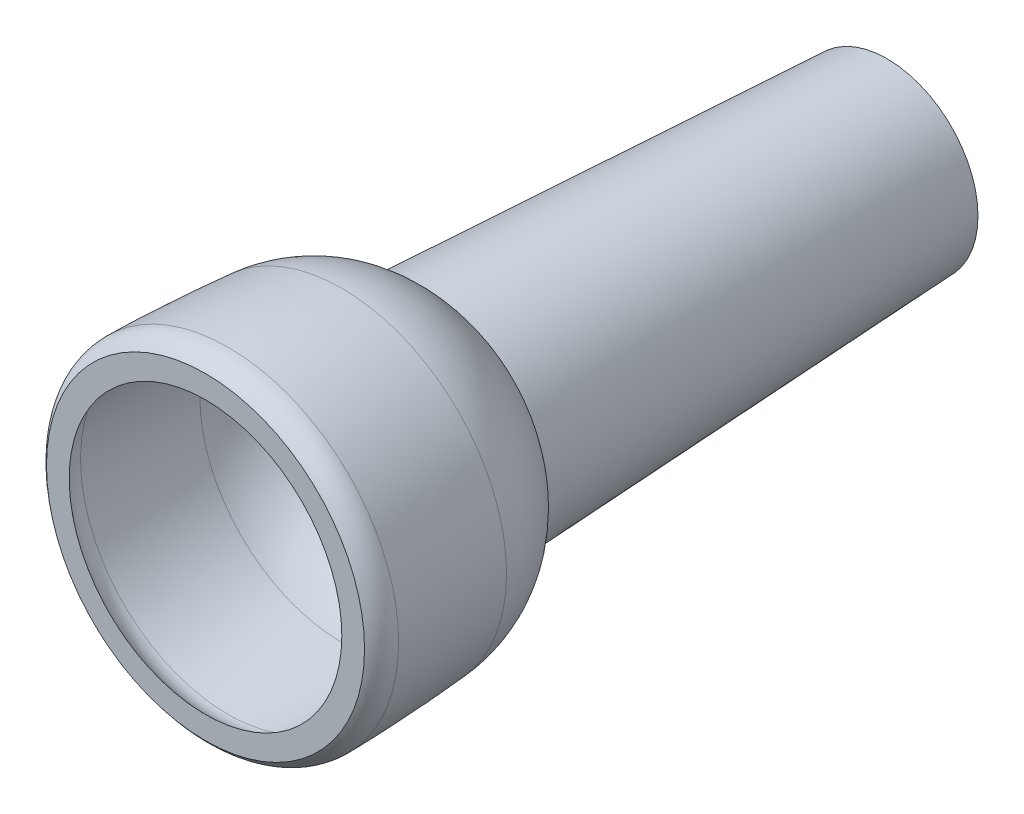
ISO-10303-21;
HEADER;
FILE_DESCRIPTION(('STEP AP214'),'2;1');
FILE_NAME('part.step','',(''),(''),'','','');
FILE_SCHEMA(('AUTOMOTIVE_DESIGN { 1 0 10303 214 1 1 1 1 }'));
ENDSEC;
DATA;
#1=APPLICATION_CONTEXT('core data for automotive mechanical design processes');
#2=APPLICATION_PROTOCOL_DEFINITION('international standard','automotive_design',2000,#1);
#3=PRODUCT_CONTEXT('',#1,'mechanical');
#4=PRODUCT('Part','Part','',(#3));
#5=PRODUCT_RELATED_PRODUCT_CATEGORY('part','',(#4));
#6=PRODUCT_DEFINITION_FORMATION('','',#4);
#7=PRODUCT_DEFINITION_CONTEXT('part definition',#1,'design');
#8=PRODUCT_DEFINITION('design','',#6,#7);
#9=PRODUCT_DEFINITION_SHAPE('','',#8);
#10=(LENGTH_UNIT() NAMED_UNIT(*) SI_UNIT(.MILLI.,.METRE.));
#11=(NAMED_UNIT(*) PLANE_ANGLE_UNIT() SI_UNIT($,.RADIAN.));
#12=(NAMED_UNIT(*) SI_UNIT($,.STERADIAN.) SOLID_ANGLE_UNIT());
#13=UNCERTAINTY_MEASURE_WITH_UNIT(LENGTH_MEASURE(1.E-05),#10,'distance_accuracy_value','');
#14=(GEOMETRIC_REPRESENTATION_CONTEXT(3) GLOBAL_UNCERTAINTY_ASSIGNED_CONTEXT((#13)) GLOBAL_UNIT_ASSIGNED_CONTEXT((#10,
#11,#12)) REPRESENTATION_CONTEXT('',''));
#15=CARTESIAN_POINT('',(0.,0.,0.));
#16=DIRECTION('',(0.,0.,1.));
#17=DIRECTION('',(1.,0.,0.));
#18=AXIS2_PLACEMENT_3D('',#15,#16,#17);
#19=CARTESIAN_POINT('',(0.,0.,-20.));
#20=DIRECTION('',(0.,0.,1.));
#21=DIRECTION('',(0.,1.,0.));
#22=AXIS2_PLACEMENT_3D('',#19,#20,#21);
#23=CONICAL_SURFACE('',#22,3.5,0.0499583957219433);
#24=CARTESIAN_POINT('',(0.,0.,-30.));
#25=DIRECTION('',(0.,0.,-1.));
#26=DIRECTION('',(1.,0.,0.));
#27=AXIS2_PLACEMENT_3D('',#24,#25,#26);
#28=CIRCLE('',#27,3.);
#29=CARTESIAN_POINT('',(0.,3.,-30.));
#30=VERTEX_POINT('',#29);
#31=CARTESIAN_POINT('',(0.,-3.,-30.));
#32=VERTEX_POINT('',#31);
#33=EDGE_CURVE('E242',#30,#32,#28,.T.);
#34=ORIENTED_EDGE('',*,*,#33,.T.);
#35=DIRECTION('',(0.,-0.0499376169438921,0.998752338877845));
#36=VECTOR('',#35,1.);
#37=CARTESIAN_POINT('',(0.,-3.5,-20.));
#38=LINE('',#37,#36);
#39=CARTESIAN_POINT('',(0.,-4.,-10.));
#40=VERTEX_POINT('',#39);
#41=EDGE_CURVE('E11',#32,#40,#38,.T.);
#42=ORIENTED_EDGE('',*,*,#41,.T.);
#43=CARTESIAN_POINT('',(0.,0.,-10.));
#44=DIRECTION('',(0.,0.,-1.));
#45=DIRECTION('',(1.,0.,0.));
#46=AXIS2_PLACEMENT_3D('',#43,#44,#45);
#47=CIRCLE('',#46,4.);
#48=CARTESIAN_POINT('',(4.,0.,-10.));
#49=VERTEX_POINT('',#48);
#50=EDGE_CURVE('E145',#49,#40,#47,.T.);
#51=ORIENTED_EDGE('',*,*,#50,.F.);
#52=CARTESIAN_POINT('',(0.,0.,-10.));
#53=DIRECTION('',(0.,0.,-1.));
#54=DIRECTION('',(1.,0.,0.));
#55=AXIS2_PLACEMENT_3D('',#52,#53,#54);
#56=CIRCLE('',#55,4.);
#57=CARTESIAN_POINT('',(0.,4.,-10.));
#58=VERTEX_POINT('',#57);
#59=EDGE_CURVE('E149',#58,#49,#56,.T.);
#60=ORIENTED_EDGE('',*,*,#59,.F.);
#61=CARTESIAN_POINT('',(0.,0.,-10.));
#62=DIRECTION('',(0.,0.,-1.));
#63=DIRECTION('',(1.,0.,0.));
#64=AXIS2_PLACEMENT_3D('',#61,#62,#63);
#65=CIRCLE('',#64,4.);
#66=EDGE_CURVE('E152',#40,#58,#65,.T.);
#67=ORIENTED_EDGE('',*,*,#66,.F.);
#68=ORIENTED_EDGE('',*,*,#41,.F.);
#69=CARTESIAN_POINT('',(0.,0.,-30.));
#70=DIRECTION('',(0.,0.,-1.));
#71=DIRECTION('',(1.,0.,0.));
#72=AXIS2_PLACEMENT_3D('',#69,#70,#71);
#73=CIRCLE('',#72,3.);
#74=EDGE_CURVE('E27',#32,#30,#73,.T.);
#75=ORIENTED_EDGE('',*,*,#74,.T.);
#76=EDGE_LOOP('',(#34,#42,#51,#60,#67,#68,#75));
#77=FACE_BOUND('',#76,.T.);
#78=ADVANCED_FACE('F16',(#77),#23,.F.);
#79=CARTESIAN_POINT('',(0.,3.,-30.));
#80=DIRECTION('',(0.,0.,-1.));
#81=DIRECTION('',(0.,-1.,0.));
#82=AXIS2_PLACEMENT_3D('',#79,#80,#81);
#83=PLANE('',#82);
#84=ORIENTED_EDGE('',*,*,#33,.F.);
#85=ORIENTED_EDGE('',*,*,#74,.F.);
#86=EDGE_LOOP('',(#84,#85));
#87=FACE_BOUND('',#86,.T.);
#88=CARTESIAN_POINT('',(0.,0.,-30.));
#89=DIRECTION('',(0.,0.,-1.));
#90=DIRECTION('',(1.,0.,0.));
#91=AXIS2_PLACEMENT_3D('',#88,#89,#90);
#92=CIRCLE('',#91,4.);
#93=CARTESIAN_POINT('',(0.,4.,-30.));
#94=VERTEX_POINT('',#93);
#95=CARTESIAN_POINT('',(0.,-4.,-30.));
#96=VERTEX_POINT('',#95);
#97=EDGE_CURVE('E220',#94,#96,#92,.T.);
#98=ORIENTED_EDGE('',*,*,#97,.T.);
#99=CARTESIAN_POINT('',(0.,0.,-30.));
#100=DIRECTION('',(0.,0.,-1.));
#101=DIRECTION('',(1.,0.,0.));
#102=AXIS2_PLACEMENT_3D('',#99,#100,#101);
#103=CIRCLE('',#102,4.);
#104=EDGE_CURVE('E216',#96,#94,#103,.T.);
#105=ORIENTED_EDGE('',*,*,#104,.T.);
#106=EDGE_LOOP('',(#98,#105));
#107=FACE_BOUND('',#106,.T.);
#108=ADVANCED_FACE('F18',(#87,#107),#83,.T.);
#109=CARTESIAN_POINT('',(0.,0.,-20.));
#110=DIRECTION('',(0.,0.,1.));
#111=DIRECTION('',(0.,1.,0.));
#112=AXIS2_PLACEMENT_3D('',#109,#110,#111);
#113=CONICAL_SURFACE('',#112,4.5,0.0499583957219433);
#114=ORIENTED_EDGE('',*,*,#97,.F.);
#115=ORIENTED_EDGE('',*,*,#104,.F.);
#116=DIRECTION('',(0.,-0.0499376169438921,0.998752338877845));
#117=VECTOR('',#116,1.);
#118=CARTESIAN_POINT('',(0.,-4.5,-20.));
#119=LINE('',#118,#117);
#120=CARTESIAN_POINT('',(0.,-5.,-10.));
#121=VERTEX_POINT('',#120);
#122=EDGE_CURVE('E219',#96,#121,#119,.T.);
#123=ORIENTED_EDGE('',*,*,#122,.T.);
#124=CARTESIAN_POINT('',(0.,0.,-10.));
#125=DIRECTION('',(0.,0.,-1.));
#126=DIRECTION('',(1.,0.,0.));
#127=AXIS2_PLACEMENT_3D('',#124,#125,#126);
#128=CIRCLE('',#127,5.);
#129=CARTESIAN_POINT('',(0.,5.,-10.));
#130=VERTEX_POINT('',#129);
#131=EDGE_CURVE('E81',#121,#130,#128,.T.);
#132=ORIENTED_EDGE('',*,*,#131,.T.);
#133=CARTESIAN_POINT('',(0.,0.,-10.));
#134=DIRECTION('',(0.,0.,-1.));
#135=DIRECTION('',(1.,0.,0.));
#136=AXIS2_PLACEMENT_3D('',#133,#134,#135);
#137=CIRCLE('',#136,5.);
#138=CARTESIAN_POINT('',(5.,0.,-10.));
#139=VERTEX_POINT('',#138);
#140=EDGE_CURVE('E173',#130,#139,#137,.T.);
#141=ORIENTED_EDGE('',*,*,#140,.T.);
#142=CARTESIAN_POINT('',(0.,0.,-10.));
#143=DIRECTION('',(0.,0.,-1.));
#144=DIRECTION('',(1.,0.,0.));
#145=AXIS2_PLACEMENT_3D('',#142,#143,#144);
#146=CIRCLE('',#145,5.);
#147=EDGE_CURVE('E179',#139,#121,#146,.T.);
#148=ORIENTED_EDGE('',*,*,#147,.T.);
#149=ORIENTED_EDGE('',*,*,#122,.F.);
#150=EDGE_LOOP('',(#114,#115,#123,#132,#141,#148,#149));
#151=FACE_BOUND('',#150,.T.);
#152=ADVANCED_FACE('F280',(#151),#113,.T.);
#153=CARTESIAN_POINT('',(7.25,0.,-6.));
#154=CARTESIAN_POINT('',(7.25,-7.25,-6.));
#155=CARTESIAN_POINT('',(0.,-7.25,-6.));
#156=CARTESIAN_POINT('',(-7.25,-7.25,-6.));
#157=CARTESIAN_POINT('',(-7.25,0.,-6.));
#158=CARTESIAN_POINT('',(-7.25,7.25,-6.));
#159=CARTESIAN_POINT('',(0.,7.25,-6.));
#160=CARTESIAN_POINT('',(7.25,7.25,-6.));
#161=CARTESIAN_POINT('',(7.25,0.,-6.));
#162=CARTESIAN_POINT('',(7.04316495893054,0.,-8.51646778939843));
#163=CARTESIAN_POINT('',(7.04316495893054,-7.04316495893054,-8.51646778939843));
#164=CARTESIAN_POINT('',(0.,-7.04316495893054,-8.51646778939843));
#165=CARTESIAN_POINT('',(-7.04316495893054,-7.04316495893054,-8.51646778939843));
#166=CARTESIAN_POINT('',(-7.04316495893054,0.,-8.51646778939843));
#167=CARTESIAN_POINT('',(-7.04316495893054,7.04316495893054,-8.51646778939843));
#168=CARTESIAN_POINT('',(0.,7.04316495893054,-8.51646778939843));
#169=CARTESIAN_POINT('',(7.04316495893054,7.04316495893054,-8.51646778939843));
#170=CARTESIAN_POINT('',(7.04316495893054,0.,-8.51646778939843));
#171=CARTESIAN_POINT('',(5.,0.,-10.));
#172=CARTESIAN_POINT('',(5.,-5.,-10.));
#173=CARTESIAN_POINT('',(0.,-5.,-10.));
#174=CARTESIAN_POINT('',(-5.,-5.,-10.));
#175=CARTESIAN_POINT('',(-5.,0.,-10.));
#176=CARTESIAN_POINT('',(-5.,5.,-10.));
#177=CARTESIAN_POINT('',(0.,5.,-10.));
#178=CARTESIAN_POINT('',(5.,5.,-10.));
#179=CARTESIAN_POINT('',(5.,0.,-10.));
#180=(BOUNDED_SURFACE() B_SPLINE_SURFACE(2,2,((#153,#154,#155,#156,#157,#158,#159,#160,#161),
(#162,#163,#164,#165,#166,#167,#168,#169,#170),(#171,#172,#173,#174,#175,#176,#177,#178,#179)),
.UNSPECIFIED.,.F.,.T.,.F.) B_SPLINE_SURFACE_WITH_KNOTS((3,3),(3,2,2,2,3),(0.0820082634081822,
0.942770657213293),(-3.14159265358979,-1.5707963267949,0.,1.5707963267949,3.14159265358979),
.UNSPECIFIED.) GEOMETRIC_REPRESENTATION_ITEM() RATIONAL_B_SPLINE_SURFACE(((1.,0.707106781186548,
1.,0.707106781186548,1.,0.707106781186548,1.,0.707106781186548,1.),(0.908806773778685,
0.642623432527177,0.908806773778685,0.642623432527177,0.908806773778685,0.642623432527177,
0.908806773778685,0.642623432527177,0.908806773778685),(1.,0.707106781186548,1.,
0.707106781186548,1.,0.707106781186548,1.,0.707106781186548,1.))) REPRESENTATION_ITEM('') SURFACE());
#181=CARTESIAN_POINT('',(1.76848436400892,0.,-5.54945995475502));
#182=DIRECTION('',(0.,-1.,0.));
#183=DIRECTION('',(1.,0.,0.));
#184=AXIS2_PLACEMENT_3D('',#181,#182,#183);
#185=CIRCLE('',#184,5.49999999999855);
#186=CARTESIAN_POINT('',(7.25,0.,-6.));
#187=VERTEX_POINT('',#186);
#188=EDGE_CURVE('E68',#139,#187,#185,.T.);
#189=CARTESIAN_POINT('',(0.,0.,-6.));
#190=DIRECTION('',(0.,0.,-1.));
#191=DIRECTION('',(1.,0.,0.));
#192=AXIS2_PLACEMENT_3D('',#189,#190,#191);
#193=CIRCLE('',#192,7.25);
#194=CARTESIAN_POINT('',(0.,7.25,-6.));
#195=VERTEX_POINT('',#194);
#196=EDGE_CURVE('E182',#187,#195,#193,.T.);
#197=CARTESIAN_POINT('',(0.,0.,-6.));
#198=DIRECTION('',(0.,0.,-1.));
#199=DIRECTION('',(1.,0.,0.));
#200=AXIS2_PLACEMENT_3D('',#197,#198,#199);
#201=CIRCLE('',#200,7.25);
#202=EDGE_CURVE('E20',#195,#187,#201,.T.);
#203=ORIENTED_EDGE('',*,*,#140,.F.);
#204=ORIENTED_EDGE('',*,*,#131,.F.);
#205=ORIENTED_EDGE('',*,*,#147,.F.);
#206=ORIENTED_EDGE('',*,*,#188,.T.);
#207=ORIENTED_EDGE('',*,*,#196,.T.);
#208=ORIENTED_EDGE('',*,*,#202,.T.);
#209=ORIENTED_EDGE('',*,*,#188,.F.);
#210=EDGE_LOOP('',(#203,#204,#205,#206,#207,#208,#209));
#211=FACE_BOUND('',#210,.T.);
#212=ADVANCED_FACE('F290',(#211),#180,.F.);
#213=CARTESIAN_POINT('',(7.5,0.,-1.));
#214=CARTESIAN_POINT('',(7.49999999999998,-7.49999999999998,-0.999999999999999));
#215=CARTESIAN_POINT('',(0.,-7.5,-1.));
#216=CARTESIAN_POINT('',(-7.49999999999998,-7.49999999999998,-0.999999999999999));
#217=CARTESIAN_POINT('',(-7.5,0.,-1.));
#218=CARTESIAN_POINT('',(-7.49999999999998,7.49999999999998,-0.999999999999999));
#219=CARTESIAN_POINT('',(0.,7.5,-1.));
#220=CARTESIAN_POINT('',(7.49999999999998,7.49999999999998,-0.999999999999999));
#221=CARTESIAN_POINT('',(7.5,0.,-1.));
#222=CARTESIAN_POINT('',(7.45515211501948,0.,-3.50400760575104));
#223=CARTESIAN_POINT('',(7.45515211501949,-7.45515211501949,-3.50400760575104));
#224=CARTESIAN_POINT('',(0.,-7.45515211501948,-3.50400760575104));
#225=CARTESIAN_POINT('',(-7.45515211501949,-7.45515211501949,-3.50400760575104));
#226=CARTESIAN_POINT('',(-7.45515211501948,0.,-3.50400760575104));
#227=CARTESIAN_POINT('',(-7.45515211501949,7.45515211501949,-3.50400760575104));
#228=CARTESIAN_POINT('',(0.,7.45515211501948,-3.50400760575104));
#229=CARTESIAN_POINT('',(7.45515211501949,7.45515211501949,-3.50400760575104));
#230=CARTESIAN_POINT('',(7.45515211501948,0.,-3.50400760575104));
#231=CARTESIAN_POINT('',(7.25,0.,-6.));
#232=CARTESIAN_POINT('',(7.25,-7.25,-6.));
#233=CARTESIAN_POINT('',(0.,-7.25,-6.));
#234=CARTESIAN_POINT('',(-7.25,-7.25,-6.));
#235=CARTESIAN_POINT('',(-7.25,0.,-6.));
#236=CARTESIAN_POINT('',(-7.25,7.25,-6.));
#237=CARTESIAN_POINT('',(0.,7.25,-6.));
#238=CARTESIAN_POINT('',(7.25,7.25,-6.));
#239=CARTESIAN_POINT('',(7.25,0.,-6.));
#240=(BOUNDED_SURFACE() B_SPLINE_SURFACE(2,2,((#213,#214,#215,#216,#217,#218,#219,#220,#221),
(#222,#223,#224,#225,#226,#227,#228,#229,#230),(#231,#232,#233,#234,#235,#236,#237,#238,#239)),
.UNSPECIFIED.,.F.,.T.,.F.) B_SPLINE_SURFACE_WITH_KNOTS((3,3),(3,2,2,2,3),(0.0179085280357101,
0.082008263408175),(-3.14159265358979,-1.5707963267949,0.,1.5707963267949,3.14159265358979),
.UNSPECIFIED.) GEOMETRIC_REPRESENTATION_ITEM() RATIONAL_B_SPLINE_SURFACE(((1.,0.707106781186548,
1.,0.707106781186548,1.,0.707106781186548,1.,0.707106781186548,1.),(0.999486446952616,
0.706743644344244,0.999486446952616,0.706743644344244,0.999486446952616,0.706743644344244,
0.999486446952616,0.706743644344244,0.999486446952616),(1.,0.707106781186548,1.,
0.707106781186548,1.,0.707106781186548,1.,0.707106781186548,1.))) REPRESENTATION_ITEM('') SURFACE());
#241=CARTESIAN_POINT('',(-70.6017320984614,0.,0.398836604923054));
#242=DIRECTION('',(0.,-1.,0.));
#243=DIRECTION('',(1.,0.,0.));
#244=AXIS2_PLACEMENT_3D('',#241,#242,#243);
#245=CIRCLE('',#244,78.1142579855119);
#246=CARTESIAN_POINT('',(7.5,0.,-1.));
#247=VERTEX_POINT('',#246);
#248=EDGE_CURVE('E176',#187,#247,#245,.T.);
#249=CARTESIAN_POINT('',(0.,0.,-1.));
#250=DIRECTION('',(0.,0.,-1.));
#251=DIRECTION('',(1.,0.,0.));
#252=AXIS2_PLACEMENT_3D('',#249,#250,#251);
#253=CIRCLE('',#252,7.5);
#254=CARTESIAN_POINT('',(0.,7.5,-1.));
#255=VERTEX_POINT('',#254);
#256=EDGE_CURVE('E113',#247,#255,#253,.T.);
#257=CARTESIAN_POINT('',(0.,0.,-1.));
#258=DIRECTION('',(0.,0.,-1.));
#259=DIRECTION('',(1.,0.,0.));
#260=AXIS2_PLACEMENT_3D('',#257,#258,#259);
#261=CIRCLE('',#260,7.5);
#262=EDGE_CURVE('E187',#255,#247,#261,.T.);
#263=ORIENTED_EDGE('',*,*,#202,.F.);
#264=ORIENTED_EDGE('',*,*,#196,.F.);
#265=ORIENTED_EDGE('',*,*,#248,.T.);
#266=ORIENTED_EDGE('',*,*,#256,.T.);
#267=ORIENTED_EDGE('',*,*,#262,.T.);
#268=ORIENTED_EDGE('',*,*,#248,.F.);
#269=EDGE_LOOP('',(#263,#264,#265,#266,#267,#268));
#270=FACE_BOUND('',#269,.T.);
#271=ADVANCED_FACE('F284',(#270),#240,.F.);
#272=CARTESIAN_POINT('',(0.,0.,-0.978386172997172));
#273=DIRECTION('',(0.,0.,-1.));
#274=DIRECTION('',(-1.,0.,0.));
#275=AXIS2_PLACEMENT_3D('',#272,#273,#274);
#276=TOROIDAL_SURFACE('',#275,6.2932276540052,1.20696588708028);
#277=ORIENTED_EDGE('',*,*,#262,.F.);
#278=ORIENTED_EDGE('',*,*,#256,.F.);
#279=CARTESIAN_POINT('',(6.2932276540052,0.,-0.978386172997172));
#280=DIRECTION('',(0.,-1.,0.));
#281=DIRECTION('',(1.,0.,0.));
#282=AXIS2_PLACEMENT_3D('',#279,#280,#281);
#283=CIRCLE('',#282,1.20696588708028);
#284=CARTESIAN_POINT('',(7.,0.,0.));
#285=VERTEX_POINT('',#284);
#286=EDGE_CURVE('E122',#247,#285,#283,.T.);
#287=ORIENTED_EDGE('',*,*,#286,.T.);
#288=CARTESIAN_POINT('',(0.,0.,0.));
#289=DIRECTION('',(0.,0.,-1.));
#290=DIRECTION('',(1.,0.,0.));
#291=AXIS2_PLACEMENT_3D('',#288,#289,#290);
#292=CIRCLE('',#291,7.);
#293=CARTESIAN_POINT('',(0.,7.,0.));
#294=VERTEX_POINT('',#293);
#295=EDGE_CURVE('E130',#285,#294,#292,.T.);
#296=ORIENTED_EDGE('',*,*,#295,.T.);
#297=CARTESIAN_POINT('',(0.,0.,0.));
#298=DIRECTION('',(0.,0.,-1.));
#299=DIRECTION('',(1.,0.,0.));
#300=AXIS2_PLACEMENT_3D('',#297,#298,#299);
#301=CIRCLE('',#300,7.);
#302=EDGE_CURVE('E188',#294,#285,#301,.T.);
#303=ORIENTED_EDGE('',*,*,#302,.T.);
#304=ORIENTED_EDGE('',*,*,#286,.F.);
#305=EDGE_LOOP('',(#277,#278,#287,#296,#303,#304));
#306=FACE_BOUND('',#305,.T.);
#307=ADVANCED_FACE('F289',(#306),#276,.T.);
#308=CARTESIAN_POINT('',(0.,7.,0.));
#309=DIRECTION('',(0.,0.,1.));
#310=DIRECTION('',(1.,0.,0.));
#311=AXIS2_PLACEMENT_3D('',#308,#309,#310);
#312=PLANE('',#311);
#313=CARTESIAN_POINT('',(0.,0.,0.));
#314=DIRECTION('',(0.,0.,-1.));
#315=DIRECTION('',(1.,0.,0.));
#316=AXIS2_PLACEMENT_3D('',#313,#314,#315);
#317=CIRCLE('',#316,6.);
#318=CARTESIAN_POINT('',(0.,6.,0.));
#319=VERTEX_POINT('',#318);
#320=CARTESIAN_POINT('',(6.,0.,0.));
#321=VERTEX_POINT('',#320);
#322=EDGE_CURVE('E171',#319,#321,#317,.T.);
#323=ORIENTED_EDGE('',*,*,#322,.T.);
#324=CARTESIAN_POINT('',(0.,0.,0.));
#325=DIRECTION('',(0.,0.,-1.));
#326=DIRECTION('',(1.,0.,0.));
#327=AXIS2_PLACEMENT_3D('',#324,#325,#326);
#328=CIRCLE('',#327,6.);
#329=EDGE_CURVE('E203',#321,#319,#328,.T.);
#330=ORIENTED_EDGE('',*,*,#329,.T.);
#331=EDGE_LOOP('',(#323,#330));
#332=FACE_BOUND('',#331,.T.);
#333=ORIENTED_EDGE('',*,*,#302,.F.);
#334=ORIENTED_EDGE('',*,*,#295,.F.);
#335=EDGE_LOOP('',(#333,#334));
#336=FACE_BOUND('',#335,.T.);
#337=ADVANCED_FACE('F271',(#332,#336),#312,.T.);
#338=CARTESIAN_POINT('',(0.,0.,-0.978386172935946));
#339=DIRECTION('',(0.,0.,-1.));
#340=DIRECTION('',(-1.,0.,0.));
#341=AXIS2_PLACEMENT_3D('',#338,#339,#340);
#342=TOROIDAL_SURFACE('',#341,5.29322765412951,1.20696588703856);
#343=CARTESIAN_POINT('',(0.,0.,-1.));
#344=DIRECTION('',(0.,0.,-1.));
#345=DIRECTION('',(1.,0.,0.));
#346=AXIS2_PLACEMENT_3D('',#343,#344,#345);
#347=CIRCLE('',#346,6.5);
#348=CARTESIAN_POINT('',(0.,6.5,-1.));
#349=VERTEX_POINT('',#348);
#350=CARTESIAN_POINT('',(6.5,0.,-1.));
#351=VERTEX_POINT('',#350);
#352=EDGE_CURVE('E209',#349,#351,#347,.T.);
#353=ORIENTED_EDGE('',*,*,#352,.T.);
#354=CARTESIAN_POINT('',(5.29322765412951,0.,-0.978386172935946));
#355=DIRECTION('',(0.,-1.,0.));
#356=DIRECTION('',(1.,0.,0.));
#357=AXIS2_PLACEMENT_3D('',#354,#355,#356);
#358=CIRCLE('',#357,1.20696588703856);
#359=EDGE_CURVE('E215',#351,#321,#358,.T.);
#360=ORIENTED_EDGE('',*,*,#359,.T.);
#361=ORIENTED_EDGE('',*,*,#322,.F.);
#362=ORIENTED_EDGE('',*,*,#329,.F.);
#363=ORIENTED_EDGE('',*,*,#359,.F.);
#364=CARTESIAN_POINT('',(0.,0.,-1.));
#365=DIRECTION('',(0.,0.,-1.));
#366=DIRECTION('',(1.,0.,0.));
#367=AXIS2_PLACEMENT_3D('',#364,#365,#366);
#368=CIRCLE('',#367,6.5);
#369=EDGE_CURVE('E212',#351,#349,#368,.T.);
#370=ORIENTED_EDGE('',*,*,#369,.T.);
#371=EDGE_LOOP('',(#353,#360,#361,#362,#363,#370));
#372=FACE_BOUND('',#371,.T.);
#373=ADVANCED_FACE('F259',(#372),#342,.F.);
#374=CARTESIAN_POINT('',(6.50000000012096,0.,-1.00000000000217));
#375=CARTESIAN_POINT('',(6.50000000012095,-6.50000000012095,-1.00000000000217));
#376=CARTESIAN_POINT('',(0.,-6.50000000012096,-1.00000000000217));
#377=CARTESIAN_POINT('',(-6.50000000012095,-6.50000000012095,-1.00000000000217));
#378=CARTESIAN_POINT('',(-6.50000000012096,0.,-1.00000000000217));
#379=CARTESIAN_POINT('',(-6.50000000012095,6.50000000012095,-1.00000000000217));
#380=CARTESIAN_POINT('',(0.,6.50000000012096,-1.00000000000217));
#381=CARTESIAN_POINT('',(6.50000000012095,6.50000000012095,-1.00000000000217));
#382=CARTESIAN_POINT('',(6.50000000012096,0.,-1.00000000000217));
#383=CARTESIAN_POINT('',(6.45515211514075,0.,-3.50400760575719));
#384=CARTESIAN_POINT('',(6.45515211514075,-6.45515211514075,-3.50400760575719));
#385=CARTESIAN_POINT('',(0.,-6.45515211514075,-3.50400760575719));
#386=CARTESIAN_POINT('',(-6.45515211514075,-6.45515211514075,-3.50400760575719));
#387=CARTESIAN_POINT('',(-6.45515211514075,0.,-3.50400760575719));
#388=CARTESIAN_POINT('',(-6.45515211514075,6.45515211514075,-3.50400760575719));
#389=CARTESIAN_POINT('',(0.,6.45515211514075,-3.50400760575719));
#390=CARTESIAN_POINT('',(6.45515211514075,6.45515211514075,-3.50400760575719));
#391=CARTESIAN_POINT('',(6.45515211514075,0.,-3.50400760575719));
#392=CARTESIAN_POINT('',(6.25000000012057,0.,-6.00000000000991));
#393=CARTESIAN_POINT('',(6.25000000012057,-6.25000000012057,-6.00000000000991));
#394=CARTESIAN_POINT('',(0.,-6.25000000012057,-6.00000000000991));
#395=CARTESIAN_POINT('',(-6.25000000012057,-6.25000000012057,-6.00000000000991));
#396=CARTESIAN_POINT('',(-6.25000000012057,0.,-6.00000000000991));
#397=CARTESIAN_POINT('',(-6.25000000012057,6.25000000012057,-6.00000000000991));
#398=CARTESIAN_POINT('',(0.,6.25000000012057,-6.00000000000991));
#399=CARTESIAN_POINT('',(6.25000000012057,6.25000000012057,-6.00000000000991));
#400=CARTESIAN_POINT('',(6.25000000012057,0.,-6.00000000000991));
#401=(BOUNDED_SURFACE() B_SPLINE_SURFACE(2,2,((#374,#375,#376,#377,#378,#379,#380,#381,#382),
(#383,#384,#385,#386,#387,#388,#389,#390,#391),(#392,#393,#394,#395,#396,#397,#398,#399,#400)),
.UNSPECIFIED.,.F.,.T.,.F.) B_SPLINE_SURFACE_WITH_KNOTS((3,3),(3,2,2,2,3),(0.0179085280355603,
0.0820082634083241),(-3.14159265358979,-1.5707963267949,0.,1.5707963267949,3.14159265358979),
.UNSPECIFIED.) GEOMETRIC_REPRESENTATION_ITEM() RATIONAL_B_SPLINE_SURFACE(((1.,0.707106781186548,
1.,0.707106781186548,1.,0.707106781186548,1.,0.707106781186548,1.),(0.999486446952961,
0.706743644344487,0.999486446952961,0.706743644344487,0.999486446952961,0.706743644344487,
0.999486446952961,0.706743644344487,0.999486446952961),(1.,0.707106781186548,1.,
0.707106781186548,1.,0.707106781186548,1.,0.707106781186548,1.))) REPRESENTATION_ITEM('') SURFACE());
#402=CARTESIAN_POINT('',(0.,0.,-6.));
#403=DIRECTION('',(0.,0.,-1.));
#404=DIRECTION('',(1.,0.,0.));
#405=AXIS2_PLACEMENT_3D('',#402,#403,#404);
#406=CIRCLE('',#405,6.25);
#407=CARTESIAN_POINT('',(0.,6.25,-6.));
#408=VERTEX_POINT('',#407);
#409=CARTESIAN_POINT('',(6.25,0.,-6.));
#410=VERTEX_POINT('',#409);
#411=EDGE_CURVE('E162',#408,#410,#406,.T.);
#412=CARTESIAN_POINT('',(-71.6017320980974,0.,0.398836604904826));
#413=DIRECTION('',(0.,-1.,0.));
#414=DIRECTION('',(1.,0.,0.));
#415=AXIS2_PLACEMENT_3D('',#412,#413,#414);
#416=CIRCLE('',#415,78.1142579852686);
#417=EDGE_CURVE('E202',#410,#351,#416,.T.);
#418=CARTESIAN_POINT('',(0.,0.,-6.));
#419=DIRECTION('',(0.,0.,-1.));
#420=DIRECTION('',(1.,0.,0.));
#421=AXIS2_PLACEMENT_3D('',#418,#419,#420);
#422=CIRCLE('',#421,6.25);
#423=EDGE_CURVE('E153',#410,#408,#422,.T.);
#424=ORIENTED_EDGE('',*,*,#411,.T.);
#425=ORIENTED_EDGE('',*,*,#417,.T.);
#426=ORIENTED_EDGE('',*,*,#352,.F.);
#427=ORIENTED_EDGE('',*,*,#369,.F.);
#428=ORIENTED_EDGE('',*,*,#417,.F.);
#429=ORIENTED_EDGE('',*,*,#423,.T.);
#430=EDGE_LOOP('',(#424,#425,#426,#427,#428,#429));
#431=FACE_BOUND('',#430,.T.);
#432=ADVANCED_FACE('F263',(#431),#401,.T.);
#433=CARTESIAN_POINT('',(6.25,0.,-6.));
#434=CARTESIAN_POINT('',(6.25,-6.25,-6.));
#435=CARTESIAN_POINT('',(0.,-6.25,-6.));
#436=CARTESIAN_POINT('',(-6.25,-6.25,-6.));
#437=CARTESIAN_POINT('',(-6.25,0.,-6.));
#438=CARTESIAN_POINT('',(-6.25,6.25,-6.));
#439=CARTESIAN_POINT('',(0.,6.25,-6.));
#440=CARTESIAN_POINT('',(6.25,6.25,-6.));
#441=CARTESIAN_POINT('',(6.25,0.,-6.));
#442=CARTESIAN_POINT('',(6.04316495893025,0.,-8.51646778939826));
#443=CARTESIAN_POINT('',(6.04316495893025,-6.04316495893025,-8.51646778939825));
#444=CARTESIAN_POINT('',(0.,-6.04316495893025,-8.51646778939826));
#445=CARTESIAN_POINT('',(-6.04316495893025,-6.04316495893025,-8.51646778939825));
#446=CARTESIAN_POINT('',(-6.04316495893025,0.,-8.51646778939826));
#447=CARTESIAN_POINT('',(-6.04316495893025,6.04316495893025,-8.51646778939825));
#448=CARTESIAN_POINT('',(0.,6.04316495893025,-8.51646778939826));
#449=CARTESIAN_POINT('',(6.04316495893025,6.04316495893025,-8.51646778939825));
#450=CARTESIAN_POINT('',(6.04316495893025,0.,-8.51646778939826));
#451=CARTESIAN_POINT('',(4.,0.,-10.));
#452=CARTESIAN_POINT('',(4.,-4.,-10.));
#453=CARTESIAN_POINT('',(0.,-4.,-10.));
#454=CARTESIAN_POINT('',(-4.,-4.,-10.));
#455=CARTESIAN_POINT('',(-4.,0.,-10.));
#456=CARTESIAN_POINT('',(-4.,4.,-10.));
#457=CARTESIAN_POINT('',(0.,4.,-10.));
#458=CARTESIAN_POINT('',(4.,4.,-10.));
#459=CARTESIAN_POINT('',(4.,0.,-10.));
#460=(BOUNDED_SURFACE() B_SPLINE_SURFACE(2,2,((#433,#434,#435,#436,#437,#438,#439,#440,#441),
(#442,#443,#444,#445,#446,#447,#448,#449,#450),(#451,#452,#453,#454,#455,#456,#457,#458,#459)),
.UNSPECIFIED.,.F.,.T.,.F.) B_SPLINE_SURFACE_WITH_KNOTS((3,3),(3,2,2,2,3),(0.0820082634083035,
0.942770657213172),(-3.14159265358979,-1.5707963267949,0.,1.5707963267949,3.14159265358979),
.UNSPECIFIED.) GEOMETRIC_REPRESENTATION_ITEM() RATIONAL_B_SPLINE_SURFACE(((1.,0.707106781186548,
1.,0.707106781186548,1.,0.707106781186548,1.,0.707106781186548,1.),(0.908806773778738,
0.642623432527214,0.908806773778738,0.642623432527214,0.908806773778738,0.642623432527214,
0.908806773778738,0.642623432527214,0.908806773778738),(1.,0.707106781186548,1.,
0.707106781186548,1.,0.707106781186548,1.,0.707106781186548,1.))) REPRESENTATION_ITEM('') SURFACE());
#461=CARTESIAN_POINT('',(0.768484364007531,0.,-5.54945995475423));
#462=DIRECTION('',(0.,-1.,0.));
#463=DIRECTION('',(1.,0.,0.));
#464=AXIS2_PLACEMENT_3D('',#461,#462,#463);
#465=CIRCLE('',#464,5.5);
#466=EDGE_CURVE('E157',#49,#410,#465,.T.);
#467=ORIENTED_EDGE('',*,*,#59,.T.);
#468=ORIENTED_EDGE('',*,*,#466,.T.);
#469=ORIENTED_EDGE('',*,*,#411,.F.);
#470=ORIENTED_EDGE('',*,*,#423,.F.);
#471=ORIENTED_EDGE('',*,*,#466,.F.);
#472=ORIENTED_EDGE('',*,*,#50,.T.);
#473=ORIENTED_EDGE('',*,*,#66,.T.);
#474=EDGE_LOOP('',(#467,#468,#469,#470,#471,#472,#473));
#475=FACE_BOUND('',#474,.T.);
#476=ADVANCED_FACE('F158',(#475),#460,.T.);
#477=CLOSED_SHELL('',(#78,#108,#152,#212,#271,#307,#337,#373,#432,#476));
#478=MANIFOLD_SOLID_BREP('B1',#477);
#479=ADVANCED_BREP_SHAPE_REPRESENTATION('',(#18,#478),#14);
#480=SHAPE_DEFINITION_REPRESENTATION(#9,#479);
ENDSEC;
END-ISO-10303-21;
